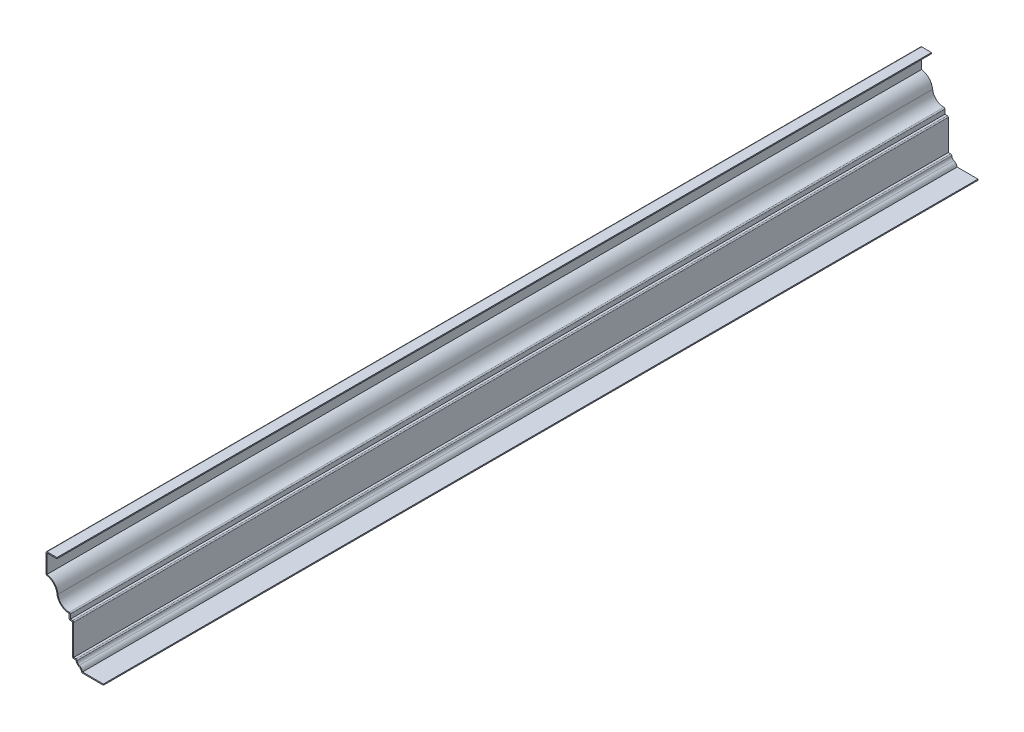
ISO-10303-21;
HEADER;
FILE_DESCRIPTION(('STEP AP214'),'2;1');
FILE_NAME('part.step','',(''),(''),'','','');
FILE_SCHEMA(('AUTOMOTIVE_DESIGN { 1 0 10303 214 1 1 1 1 }'));
ENDSEC;
DATA;
#1=APPLICATION_CONTEXT('core data for automotive mechanical design processes');
#2=APPLICATION_PROTOCOL_DEFINITION('international standard','automotive_design',2000,#1);
#3=PRODUCT_CONTEXT('',#1,'mechanical');
#4=PRODUCT('Part','Part','',(#3));
#5=PRODUCT_RELATED_PRODUCT_CATEGORY('part','',(#4));
#6=PRODUCT_DEFINITION_FORMATION('','',#4);
#7=PRODUCT_DEFINITION_CONTEXT('part definition',#1,'design');
#8=PRODUCT_DEFINITION('design','',#6,#7);
#9=PRODUCT_DEFINITION_SHAPE('','',#8);
#10=(LENGTH_UNIT() NAMED_UNIT(*) SI_UNIT(.MILLI.,.METRE.));
#11=(NAMED_UNIT(*) PLANE_ANGLE_UNIT() SI_UNIT($,.RADIAN.));
#12=(NAMED_UNIT(*) SI_UNIT($,.STERADIAN.) SOLID_ANGLE_UNIT());
#13=UNCERTAINTY_MEASURE_WITH_UNIT(LENGTH_MEASURE(1.E-05),#10,'distance_accuracy_value','');
#14=(GEOMETRIC_REPRESENTATION_CONTEXT(3) GLOBAL_UNCERTAINTY_ASSIGNED_CONTEXT((#13)) GLOBAL_UNIT_ASSIGNED_CONTEXT((#10,
#11,#12)) REPRESENTATION_CONTEXT('',''));
#15=CARTESIAN_POINT('',(0.,0.,0.));
#16=DIRECTION('',(0.,0.,1.));
#17=DIRECTION('',(1.,0.,0.));
#18=AXIS2_PLACEMENT_3D('',#15,#16,#17);
#19=CARTESIAN_POINT('',(-66.675,100.33,-1016.));
#20=DIRECTION('',(0.,-1.,0.));
#21=DIRECTION('',(0.,0.,-1.));
#22=AXIS2_PLACEMENT_3D('',#19,#20,#21);
#23=PLANE('',#22);
#24=DIRECTION('',(1.,0.,0.));
#25=VECTOR('',#24,1.);
#26=CARTESIAN_POINT('',(-66.675,100.33,0.));
#27=LINE('',#26,#25);
#28=CARTESIAN_POINT('',(-65.405,100.33,0.));
#29=VERTEX_POINT('',#28);
#30=CARTESIAN_POINT('',(-53.975,100.33,0.));
#31=VERTEX_POINT('',#30);
#32=EDGE_CURVE('E327',#29,#31,#27,.T.);
#33=ORIENTED_EDGE('',*,*,#32,.F.);
#34=DIRECTION('',(0.,0.,1.));
#35=VECTOR('',#34,1.);
#36=CARTESIAN_POINT('',(-65.405,100.33,-1016.));
#37=LINE('',#36,#35);
#38=CARTESIAN_POINT('',(-65.405,100.33,-1016.));
#39=VERTEX_POINT('',#38);
#40=EDGE_CURVE('E269',#39,#29,#37,.T.);
#41=ORIENTED_EDGE('',*,*,#40,.F.);
#42=DIRECTION('',(1.,0.,0.));
#43=VECTOR('',#42,1.);
#44=CARTESIAN_POINT('',(-66.675,100.33,-1016.));
#45=LINE('',#44,#43);
#46=CARTESIAN_POINT('',(-53.975,100.33,-1016.));
#47=VERTEX_POINT('',#46);
#48=EDGE_CURVE('E251',#39,#47,#45,.T.);
#49=ORIENTED_EDGE('',*,*,#48,.T.);
#50=DIRECTION('',(0.,0.,1.));
#51=VECTOR('',#50,1.);
#52=CARTESIAN_POINT('',(-53.975,100.33,-1016.));
#53=LINE('',#52,#51);
#54=EDGE_CURVE('E259',#47,#31,#53,.T.);
#55=ORIENTED_EDGE('',*,*,#54,.T.);
#56=EDGE_LOOP('',(#33,#41,#49,#55));
#57=FACE_BOUND('',#56,.T.);
#58=ADVANCED_FACE('F35',(#57),#23,.T.);
#59=CARTESIAN_POINT('',(-65.405,77.7875,-1016.));
#60=DIRECTION('',(1.,0.,0.));
#61=DIRECTION('',(0.,0.,-1.));
#62=AXIS2_PLACEMENT_3D('',#59,#60,#61);
#63=PLANE('',#62);
#64=DIRECTION('',(0.,1.,0.));
#65=VECTOR('',#64,1.);
#66=CARTESIAN_POINT('',(-65.405,77.7875,0.));
#67=LINE('',#66,#65);
#68=CARTESIAN_POINT('',(-65.405,78.882322780888,0.));
#69=VERTEX_POINT('',#68);
#70=EDGE_CURVE('E270',#69,#29,#67,.T.);
#71=ORIENTED_EDGE('',*,*,#70,.F.);
#72=DIRECTION('',(0.,0.,1.));
#73=VECTOR('',#72,1.);
#74=CARTESIAN_POINT('',(-65.405,78.882322780888,-1016.));
#75=LINE('',#74,#73);
#76=CARTESIAN_POINT('',(-65.405,78.882322780888,-1016.));
#77=VERTEX_POINT('',#76);
#78=EDGE_CURVE('E383',#77,#69,#75,.T.);
#79=ORIENTED_EDGE('',*,*,#78,.F.);
#80=DIRECTION('',(0.,1.,0.));
#81=VECTOR('',#80,1.);
#82=CARTESIAN_POINT('',(-65.405,77.7875,-1016.));
#83=LINE('',#82,#81);
#84=EDGE_CURVE('E267',#77,#39,#83,.T.);
#85=ORIENTED_EDGE('',*,*,#84,.T.);
#86=ORIENTED_EDGE('',*,*,#40,.T.);
#87=EDGE_LOOP('',(#71,#79,#85,#86));
#88=FACE_BOUND('',#87,.T.);
#89=ADVANCED_FACE('F506',(#88),#63,.T.);
#90=CARTESIAN_POINT('',(-68.2625,63.4944115243071,-1016.));
#91=DIRECTION('',(0.,0.,1.));
#92=DIRECTION('',(1.,0.,0.));
#93=AXIS2_PLACEMENT_3D('',#90,#91,#92);
#94=CYLINDRICAL_SURFACE('',#93,15.650978215128);
#95=CARTESIAN_POINT('',(-68.2625,63.4944115243071,0.));
#96=DIRECTION('',(0.,0.,1.));
#97=DIRECTION('',(1.,0.,0.));
#98=AXIS2_PLACEMENT_3D('',#95,#96,#97);
#99=CIRCLE('',#98,15.650978215128);
#100=CARTESIAN_POINT('',(-52.7132551639699,65.2760130845893,0.));
#101=VERTEX_POINT('',#100);
#102=EDGE_CURVE('E273',#101,#69,#99,.T.);
#103=ORIENTED_EDGE('',*,*,#102,.F.);
#104=DIRECTION('',(0.,0.,1.));
#105=VECTOR('',#104,1.);
#106=CARTESIAN_POINT('',(-52.7132551639699,65.2760130845893,-1016.));
#107=LINE('',#106,#105);
#108=CARTESIAN_POINT('',(-52.7132551639699,65.2760130845893,-1016.));
#109=VERTEX_POINT('',#108);
#110=EDGE_CURVE('E385',#109,#101,#107,.T.);
#111=ORIENTED_EDGE('',*,*,#110,.F.);
#112=CARTESIAN_POINT('',(-68.2625,63.4944115243071,-1016.));
#113=DIRECTION('',(0.,0.,1.));
#114=DIRECTION('',(1.,0.,0.));
#115=AXIS2_PLACEMENT_3D('',#112,#113,#114);
#116=CIRCLE('',#115,15.650978215128);
#117=EDGE_CURVE('E323',#109,#77,#116,.T.);
#118=ORIENTED_EDGE('',*,*,#117,.T.);
#119=ORIENTED_EDGE('',*,*,#78,.T.);
#120=EDGE_LOOP('',(#103,#111,#118,#119));
#121=FACE_BOUND('',#120,.T.);
#122=ADVANCED_FACE('F512',(#121),#94,.T.);
#123=CARTESIAN_POINT('',(-39.6875,66.768478215128,-1016.));
#124=DIRECTION('',(0.,0.,1.));
#125=DIRECTION('',(1.,0.,0.));
#126=AXIS2_PLACEMENT_3D('',#123,#124,#125);
#127=CYLINDRICAL_SURFACE('',#126,13.110978215128);
#128=CARTESIAN_POINT('',(-39.6875,66.768478215128,0.));
#129=DIRECTION('',(0.,0.,1.));
#130=DIRECTION('',(1.,0.,0.));
#131=AXIS2_PLACEMENT_3D('',#128,#129,#130);
#132=CIRCLE('',#131,13.110978215128);
#133=CARTESIAN_POINT('',(-39.6875,53.6575,0.));
#134=VERTEX_POINT('',#133);
#135=EDGE_CURVE('E377',#134,#101,#132,.F.);
#136=ORIENTED_EDGE('',*,*,#135,.F.);
#137=DIRECTION('',(0.,0.,1.));
#138=VECTOR('',#137,1.);
#139=CARTESIAN_POINT('',(-39.6875,53.6575,-1016.));
#140=LINE('',#139,#138);
#141=CARTESIAN_POINT('',(-39.6875,53.6575,-1016.));
#142=VERTEX_POINT('',#141);
#143=EDGE_CURVE('E477',#134,#142,#140,.F.);
#144=ORIENTED_EDGE('',*,*,#143,.T.);
#145=CARTESIAN_POINT('',(-39.6875,66.768478215128,-1016.));
#146=DIRECTION('',(0.,0.,1.));
#147=DIRECTION('',(1.,0.,0.));
#148=AXIS2_PLACEMENT_3D('',#145,#146,#147);
#149=CIRCLE('',#148,13.110978215128);
#150=EDGE_CURVE('E321',#142,#109,#149,.F.);
#151=ORIENTED_EDGE('',*,*,#150,.T.);
#152=ORIENTED_EDGE('',*,*,#110,.T.);
#153=EDGE_LOOP('',(#136,#144,#151,#152));
#154=FACE_BOUND('',#153,.T.);
#155=ADVANCED_FACE('F515',(#154),#127,.F.);
#156=CARTESIAN_POINT('',(-38.4175,46.0375,-1016.));
#157=DIRECTION('',(1.,0.,0.));
#158=DIRECTION('',(0.,1.,0.));
#159=AXIS2_PLACEMENT_3D('',#156,#157,#158);
#160=PLANE('',#159);
#161=DIRECTION('',(0.,1.,0.));
#162=VECTOR('',#161,1.);
#163=CARTESIAN_POINT('',(-38.4175,46.0375,-1016.));
#164=LINE('',#163,#162);
#165=CARTESIAN_POINT('',(-38.4175,47.3075,-1016.));
#166=VERTEX_POINT('',#165);
#167=CARTESIAN_POINT('',(-38.4175,52.3875,-1016.));
#168=VERTEX_POINT('',#167);
#169=EDGE_CURVE('E318',#166,#168,#164,.T.);
#170=ORIENTED_EDGE('',*,*,#169,.T.);
#171=DIRECTION('',(0.,0.,1.));
#172=VECTOR('',#171,1.);
#173=CARTESIAN_POINT('',(-38.4175,52.3875,-1016.));
#174=LINE('',#173,#172);
#175=CARTESIAN_POINT('',(-38.4175,52.3875,0.));
#176=VERTEX_POINT('',#175);
#177=EDGE_CURVE('E474',#168,#176,#174,.T.);
#178=ORIENTED_EDGE('',*,*,#177,.T.);
#179=DIRECTION('',(0.,1.,0.));
#180=VECTOR('',#179,1.);
#181=CARTESIAN_POINT('',(-38.4175,46.0375,0.));
#182=LINE('',#181,#180);
#183=CARTESIAN_POINT('',(-38.4175,47.3075,0.));
#184=VERTEX_POINT('',#183);
#185=EDGE_CURVE('E374',#184,#176,#182,.T.);
#186=ORIENTED_EDGE('',*,*,#185,.F.);
#187=DIRECTION('',(0.,0.,1.));
#188=VECTOR('',#187,1.);
#189=CARTESIAN_POINT('',(-38.4175,47.3075,-1016.));
#190=LINE('',#189,#188);
#191=EDGE_CURVE('E388',#166,#184,#190,.T.);
#192=ORIENTED_EDGE('',*,*,#191,.F.);
#193=EDGE_LOOP('',(#170,#178,#186,#192));
#194=FACE_BOUND('',#193,.T.);
#195=ADVANCED_FACE('F524',(#194),#160,.T.);
#196=CARTESIAN_POINT('',(-35.71875,47.3075,-1016.));
#197=DIRECTION('',(0.,1.,0.));
#198=DIRECTION('',(0.,0.,1.));
#199=AXIS2_PLACEMENT_3D('',#196,#197,#198);
#200=PLANE('',#199);
#201=DIRECTION('',(1.,0.,0.));
#202=VECTOR('',#201,1.);
#203=CARTESIAN_POINT('',(-35.71875,47.3075,0.));
#204=LINE('',#203,#202);
#205=CARTESIAN_POINT('',(-35.71875,47.3075,0.));
#206=VERTEX_POINT('',#205);
#207=EDGE_CURVE('E372',#206,#184,#204,.F.);
#208=ORIENTED_EDGE('',*,*,#207,.F.);
#209=DIRECTION('',(0.,0.,1.));
#210=VECTOR('',#209,1.);
#211=CARTESIAN_POINT('',(-35.71875,47.3075,-1016.));
#212=LINE('',#211,#210);
#213=CARTESIAN_POINT('',(-35.71875,47.3075,-1016.));
#214=VERTEX_POINT('',#213);
#215=EDGE_CURVE('E467',#206,#214,#212,.F.);
#216=ORIENTED_EDGE('',*,*,#215,.T.);
#217=DIRECTION('',(1.,0.,0.));
#218=VECTOR('',#217,1.);
#219=CARTESIAN_POINT('',(-35.71875,47.3075,-1016.));
#220=LINE('',#219,#218);
#221=EDGE_CURVE('E316',#214,#166,#220,.F.);
#222=ORIENTED_EDGE('',*,*,#221,.T.);
#223=ORIENTED_EDGE('',*,*,#191,.T.);
#224=EDGE_LOOP('',(#208,#216,#222,#223));
#225=FACE_BOUND('',#224,.T.);
#226=ADVANCED_FACE('F528',(#225),#200,.T.);
#227=CARTESIAN_POINT('',(-34.44875,9.52499999999997,-1016.));
#228=DIRECTION('',(1.,0.,0.));
#229=DIRECTION('',(0.,1.,0.));
#230=AXIS2_PLACEMENT_3D('',#227,#228,#229);
#231=PLANE('',#230);
#232=DIRECTION('',(0.,1.,0.));
#233=VECTOR('',#232,1.);
#234=CARTESIAN_POINT('',(-34.44875,9.52499999999997,-1016.));
#235=LINE('',#234,#233);
#236=CARTESIAN_POINT('',(-34.44875,10.795,-1016.));
#237=VERTEX_POINT('',#236);
#238=CARTESIAN_POINT('',(-34.44875,46.0375,-1016.));
#239=VERTEX_POINT('',#238);
#240=EDGE_CURVE('E313',#237,#239,#235,.T.);
#241=ORIENTED_EDGE('',*,*,#240,.T.);
#242=DIRECTION('',(0.,0.,1.));
#243=VECTOR('',#242,1.);
#244=CARTESIAN_POINT('',(-34.44875,46.0375,-1016.));
#245=LINE('',#244,#243);
#246=CARTESIAN_POINT('',(-34.44875,46.0375,0.));
#247=VERTEX_POINT('',#246);
#248=EDGE_CURVE('E464',#239,#247,#245,.T.);
#249=ORIENTED_EDGE('',*,*,#248,.T.);
#250=DIRECTION('',(0.,1.,0.));
#251=VECTOR('',#250,1.);
#252=CARTESIAN_POINT('',(-34.44875,9.52499999999997,0.));
#253=LINE('',#252,#251);
#254=CARTESIAN_POINT('',(-34.44875,10.795,0.));
#255=VERTEX_POINT('',#254);
#256=EDGE_CURVE('E369',#255,#247,#253,.T.);
#257=ORIENTED_EDGE('',*,*,#256,.F.);
#258=DIRECTION('',(0.,0.,1.));
#259=VECTOR('',#258,1.);
#260=CARTESIAN_POINT('',(-34.44875,10.795,-1016.));
#261=LINE('',#260,#259);
#262=EDGE_CURVE('E391',#237,#255,#261,.T.);
#263=ORIENTED_EDGE('',*,*,#262,.F.);
#264=EDGE_LOOP('',(#241,#249,#257,#263));
#265=FACE_BOUND('',#264,.T.);
#266=ADVANCED_FACE('F537',(#265),#231,.T.);
#267=CARTESIAN_POINT('',(-31.75,10.795,-1016.));
#268=DIRECTION('',(0.,1.,0.));
#269=DIRECTION('',(-1.,0.,0.));
#270=AXIS2_PLACEMENT_3D('',#267,#268,#269);
#271=PLANE('',#270);
#272=DIRECTION('',(-1.,0.,0.));
#273=VECTOR('',#272,1.);
#274=CARTESIAN_POINT('',(-31.75,10.795,0.));
#275=LINE('',#274,#273);
#276=CARTESIAN_POINT('',(-31.75,10.795,0.));
#277=VERTEX_POINT('',#276);
#278=EDGE_CURVE('E367',#277,#255,#275,.T.);
#279=ORIENTED_EDGE('',*,*,#278,.F.);
#280=DIRECTION('',(0.,0.,1.));
#281=VECTOR('',#280,1.);
#282=CARTESIAN_POINT('',(-31.75,10.795,-1016.));
#283=LINE('',#282,#281);
#284=CARTESIAN_POINT('',(-31.75,10.795,-1016.));
#285=VERTEX_POINT('',#284);
#286=EDGE_CURVE('E457',#277,#285,#283,.F.);
#287=ORIENTED_EDGE('',*,*,#286,.T.);
#288=DIRECTION('',(-1.,0.,0.));
#289=VECTOR('',#288,1.);
#290=CARTESIAN_POINT('',(-31.75,10.795,-1016.));
#291=LINE('',#290,#289);
#292=EDGE_CURVE('E311',#285,#237,#291,.T.);
#293=ORIENTED_EDGE('',*,*,#292,.T.);
#294=ORIENTED_EDGE('',*,*,#262,.T.);
#295=EDGE_LOOP('',(#279,#287,#293,#294));
#296=FACE_BOUND('',#295,.T.);
#297=ADVANCED_FACE('F542',(#296),#271,.T.);
#298=CARTESIAN_POINT('',(-26.590625,9.52499999999997,-1016.));
#299=DIRECTION('',(0.,0.,1.));
#300=DIRECTION('',(1.,0.,0.));
#301=AXIS2_PLACEMENT_3D('',#298,#299,#300);
#302=CYLINDRICAL_SURFACE('',#301,3.88937499999999);
#303=CARTESIAN_POINT('',(-26.590625,9.52499999999997,-1016.));
#304=DIRECTION('',(0.,0.,1.));
#305=DIRECTION('',(1.,0.,0.));
#306=AXIS2_PLACEMENT_3D('',#303,#304,#305);
#307=CIRCLE('',#306,3.88937499999999);
#308=CARTESIAN_POINT('',(-28.0865384615385,5.93480769230767,-1016.));
#309=VERTEX_POINT('',#308);
#310=CARTESIAN_POINT('',(-30.48,9.52499999999997,-1016.));
#311=VERTEX_POINT('',#310);
#312=EDGE_CURVE('E308',#309,#311,#307,.F.);
#313=ORIENTED_EDGE('',*,*,#312,.T.);
#314=DIRECTION('',(0.,0.,1.));
#315=VECTOR('',#314,1.);
#316=CARTESIAN_POINT('',(-30.48,9.52499999999997,-1016.));
#317=LINE('',#316,#315);
#318=CARTESIAN_POINT('',(-30.48,9.52499999999997,0.));
#319=VERTEX_POINT('',#318);
#320=EDGE_CURVE('E454',#311,#319,#317,.T.);
#321=ORIENTED_EDGE('',*,*,#320,.T.);
#322=CARTESIAN_POINT('',(-26.590625,9.52499999999997,0.));
#323=DIRECTION('',(0.,0.,1.));
#324=DIRECTION('',(1.,0.,0.));
#325=AXIS2_PLACEMENT_3D('',#322,#323,#324);
#326=CIRCLE('',#325,3.88937499999999);
#327=CARTESIAN_POINT('',(-28.0865384615385,5.93480769230767,0.));
#328=VERTEX_POINT('',#327);
#329=EDGE_CURVE('E364',#328,#319,#326,.F.);
#330=ORIENTED_EDGE('',*,*,#329,.F.);
#331=DIRECTION('',(0.,0.,1.));
#332=VECTOR('',#331,1.);
#333=CARTESIAN_POINT('',(-28.0865384615385,5.93480769230767,-1016.));
#334=LINE('',#333,#332);
#335=EDGE_CURVE('E394',#309,#328,#334,.T.);
#336=ORIENTED_EDGE('',*,*,#335,.F.);
#337=EDGE_LOOP('',(#313,#321,#330,#336));
#338=FACE_BOUND('',#337,.T.);
#339=ADVANCED_FACE('F551',(#338),#302,.F.);
#340=CARTESIAN_POINT('',(-30.559375,0.,-1016.));
#341=DIRECTION('',(0.,0.,1.));
#342=DIRECTION('',(1.,0.,0.));
#343=AXIS2_PLACEMENT_3D('',#340,#341,#342);
#344=CYLINDRICAL_SURFACE('',#343,6.42937499999999);
#345=CARTESIAN_POINT('',(-30.559375,0.,0.));
#346=DIRECTION('',(0.,0.,1.));
#347=DIRECTION('',(1.,0.,0.));
#348=AXIS2_PLACEMENT_3D('',#345,#346,#347);
#349=CIRCLE('',#348,6.42937499999999);
#350=CARTESIAN_POINT('',(-24.2566801088741,1.27,0.));
#351=VERTEX_POINT('',#350);
#352=EDGE_CURVE('E361',#351,#328,#349,.T.);
#353=ORIENTED_EDGE('',*,*,#352,.F.);
#354=DIRECTION('',(0.,0.,1.));
#355=VECTOR('',#354,1.);
#356=CARTESIAN_POINT('',(-24.2566801088741,1.27,-1016.));
#357=LINE('',#356,#355);
#358=CARTESIAN_POINT('',(-24.2566801088741,1.27,-1016.));
#359=VERTEX_POINT('',#358);
#360=EDGE_CURVE('E396',#359,#351,#357,.T.);
#361=ORIENTED_EDGE('',*,*,#360,.F.);
#362=CARTESIAN_POINT('',(-30.559375,0.,-1016.));
#363=DIRECTION('',(0.,0.,1.));
#364=DIRECTION('',(1.,0.,0.));
#365=AXIS2_PLACEMENT_3D('',#362,#363,#364);
#366=CIRCLE('',#365,6.42937499999999);
#367=EDGE_CURVE('E305',#359,#309,#366,.T.);
#368=ORIENTED_EDGE('',*,*,#367,.T.);
#369=ORIENTED_EDGE('',*,*,#335,.T.);
#370=EDGE_LOOP('',(#353,#361,#368,#369));
#371=FACE_BOUND('',#370,.T.);
#372=ADVANCED_FACE('F556',(#371),#344,.T.);
#373=CARTESIAN_POINT('',(0.,1.27,-1016.));
#374=DIRECTION('',(0.,1.,0.));
#375=DIRECTION('',(-1.,0.,0.));
#376=AXIS2_PLACEMENT_3D('',#373,#374,#375);
#377=PLANE('',#376);
#378=DIRECTION('',(-1.,0.,0.));
#379=VECTOR('',#378,1.);
#380=CARTESIAN_POINT('',(0.,1.27,0.));
#381=LINE('',#380,#379);
#382=CARTESIAN_POINT('',(0.,1.27,0.));
#383=VERTEX_POINT('',#382);
#384=EDGE_CURVE('E358',#383,#351,#381,.T.);
#385=ORIENTED_EDGE('',*,*,#384,.F.);
#386=DIRECTION('',(0.,0.,1.));
#387=VECTOR('',#386,1.);
#388=CARTESIAN_POINT('',(0.,1.27,-1016.));
#389=LINE('',#388,#387);
#390=CARTESIAN_POINT('',(0.,1.27,-1016.));
#391=VERTEX_POINT('',#390);
#392=EDGE_CURVE('E398',#391,#383,#389,.T.);
#393=ORIENTED_EDGE('',*,*,#392,.F.);
#394=DIRECTION('',(-1.,0.,0.));
#395=VECTOR('',#394,1.);
#396=CARTESIAN_POINT('',(0.,1.27,-1016.));
#397=LINE('',#396,#395);
#398=EDGE_CURVE('E302',#391,#359,#397,.T.);
#399=ORIENTED_EDGE('',*,*,#398,.T.);
#400=ORIENTED_EDGE('',*,*,#360,.T.);
#401=EDGE_LOOP('',(#385,#393,#399,#400));
#402=FACE_BOUND('',#401,.T.);
#403=ADVANCED_FACE('F560',(#402),#377,.T.);
#404=CARTESIAN_POINT('',(0.,1.27,-1016.));
#405=DIRECTION('',(-1.,0.,0.));
#406=DIRECTION('',(0.,-1.,0.));
#407=AXIS2_PLACEMENT_3D('',#404,#405,#406);
#408=PLANE('',#407);
#409=DIRECTION('',(0.,-1.,0.));
#410=VECTOR('',#409,1.);
#411=CARTESIAN_POINT('',(0.,1.27,0.));
#412=LINE('',#411,#410);
#413=CARTESIAN_POINT('',(0.,0.,0.));
#414=VERTEX_POINT('',#413);
#415=EDGE_CURVE('E356',#383,#414,#412,.T.);
#416=ORIENTED_EDGE('',*,*,#415,.T.);
#417=DIRECTION('',(0.,0.,1.));
#418=VECTOR('',#417,1.);
#419=CARTESIAN_POINT('',(0.,0.,-1016.));
#420=LINE('',#419,#418);
#421=CARTESIAN_POINT('',(0.,0.,-1016.));
#422=VERTEX_POINT('',#421);
#423=EDGE_CURVE('E400',#422,#414,#420,.T.);
#424=ORIENTED_EDGE('',*,*,#423,.F.);
#425=DIRECTION('',(0.,-1.,0.));
#426=VECTOR('',#425,1.);
#427=CARTESIAN_POINT('',(0.,1.27,-1016.));
#428=LINE('',#427,#426);
#429=EDGE_CURVE('E300',#391,#422,#428,.T.);
#430=ORIENTED_EDGE('',*,*,#429,.F.);
#431=ORIENTED_EDGE('',*,*,#392,.T.);
#432=EDGE_LOOP('',(#416,#424,#430,#431));
#433=FACE_BOUND('',#432,.T.);
#434=ADVANCED_FACE('F564',(#433),#408,.F.);
#435=CARTESIAN_POINT('',(0.,0.,-1016.));
#436=DIRECTION('',(0.,1.,0.));
#437=DIRECTION('',(-1.,0.,0.));
#438=AXIS2_PLACEMENT_3D('',#435,#436,#437);
#439=PLANE('',#438);
#440=DIRECTION('',(-1.,0.,0.));
#441=VECTOR('',#440,1.);
#442=CARTESIAN_POINT('',(0.,0.,0.));
#443=LINE('',#442,#441);
#444=CARTESIAN_POINT('',(-24.2566801088741,0.,0.));
#445=VERTEX_POINT('',#444);
#446=EDGE_CURVE('E353',#414,#445,#443,.T.);
#447=ORIENTED_EDGE('',*,*,#446,.T.);
#448=DIRECTION('',(0.,0.,1.));
#449=VECTOR('',#448,1.);
#450=CARTESIAN_POINT('',(-24.2566801088741,0.,-1016.));
#451=LINE('',#450,#449);
#452=CARTESIAN_POINT('',(-24.2566801088741,0.,-1016.));
#453=VERTEX_POINT('',#452);
#454=EDGE_CURVE('E437',#445,#453,#451,.F.);
#455=ORIENTED_EDGE('',*,*,#454,.T.);
#456=DIRECTION('',(-1.,0.,0.));
#457=VECTOR('',#456,1.);
#458=CARTESIAN_POINT('',(0.,0.,-1016.));
#459=LINE('',#458,#457);
#460=EDGE_CURVE('E298',#422,#453,#459,.T.);
#461=ORIENTED_EDGE('',*,*,#460,.F.);
#462=ORIENTED_EDGE('',*,*,#423,.T.);
#463=EDGE_LOOP('',(#447,#455,#461,#462));
#464=FACE_BOUND('',#463,.T.);
#465=ADVANCED_FACE('F769',(#464),#439,.F.);
#466=CARTESIAN_POINT('',(-30.559375,0.,-1016.));
#467=DIRECTION('',(0.,0.,1.));
#468=DIRECTION('',(1.,0.,0.));
#469=AXIS2_PLACEMENT_3D('',#466,#467,#468);
#470=CYLINDRICAL_SURFACE('',#469,5.15937499999999);
#471=CARTESIAN_POINT('',(-30.559375,0.,-1016.));
#472=DIRECTION('',(0.,0.,1.));
#473=DIRECTION('',(1.,0.,0.));
#474=AXIS2_PLACEMENT_3D('',#471,#472,#473);
#475=CIRCLE('',#474,5.15937499999999);
#476=CARTESIAN_POINT('',(-25.5016568774915,1.01913580246913,-1016.));
#477=VERTEX_POINT('',#476);
#478=CARTESIAN_POINT('',(-28.575,4.76249999999998,-1016.));
#479=VERTEX_POINT('',#478);
#480=EDGE_CURVE('E296',#477,#479,#475,.T.);
#481=ORIENTED_EDGE('',*,*,#480,.F.);
#482=DIRECTION('',(0.,0.,1.));
#483=VECTOR('',#482,1.);
#484=CARTESIAN_POINT('',(-25.5016568774915,1.01913580246913,-1016.));
#485=LINE('',#484,#483);
#486=CARTESIAN_POINT('',(-25.5016568774915,1.01913580246913,0.));
#487=VERTEX_POINT('',#486);
#488=EDGE_CURVE('E382',#477,#487,#485,.T.);
#489=ORIENTED_EDGE('',*,*,#488,.T.);
#490=CARTESIAN_POINT('',(-30.559375,0.,0.));
#491=DIRECTION('',(0.,0.,1.));
#492=DIRECTION('',(1.,0.,0.));
#493=AXIS2_PLACEMENT_3D('',#490,#491,#492);
#494=CIRCLE('',#493,5.15937499999999);
#495=CARTESIAN_POINT('',(-28.575,4.76249999999998,0.));
#496=VERTEX_POINT('',#495);
#497=EDGE_CURVE('E351',#487,#496,#494,.T.);
#498=ORIENTED_EDGE('',*,*,#497,.T.);
#499=DIRECTION('',(0.,0.,1.));
#500=VECTOR('',#499,1.);
#501=CARTESIAN_POINT('',(-28.575,4.76249999999998,-1016.));
#502=LINE('',#501,#500);
#503=EDGE_CURVE('E403',#479,#496,#502,.T.);
#504=ORIENTED_EDGE('',*,*,#503,.F.);
#505=EDGE_LOOP('',(#481,#489,#498,#504));
#506=FACE_BOUND('',#505,.T.);
#507=ADVANCED_FACE('F574',(#506),#470,.F.);
#508=CARTESIAN_POINT('',(-26.590625,9.52499999999997,-1016.));
#509=DIRECTION('',(0.,0.,1.));
#510=DIRECTION('',(1.,0.,0.));
#511=AXIS2_PLACEMENT_3D('',#508,#509,#510);
#512=CYLINDRICAL_SURFACE('',#511,5.15937499999999);
#513=CARTESIAN_POINT('',(-26.590625,9.52499999999997,0.));
#514=DIRECTION('',(0.,0.,-1.));
#515=DIRECTION('',(-1.,0.,0.));
#516=AXIS2_PLACEMENT_3D('',#513,#514,#515);
#517=CIRCLE('',#516,5.15937499999999);
#518=CARTESIAN_POINT('',(-31.75,9.52499999999997,0.));
#519=VERTEX_POINT('',#518);
#520=EDGE_CURVE('E349',#496,#519,#517,.T.);
#521=ORIENTED_EDGE('',*,*,#520,.T.);
#522=DIRECTION('',(0.,0.,1.));
#523=VECTOR('',#522,1.);
#524=CARTESIAN_POINT('',(-31.75,9.52499999999997,-1016.));
#525=LINE('',#524,#523);
#526=CARTESIAN_POINT('',(-31.75,9.52499999999997,-1016.));
#527=VERTEX_POINT('',#526);
#528=EDGE_CURVE('E406',#527,#519,#525,.T.);
#529=ORIENTED_EDGE('',*,*,#528,.F.);
#530=CARTESIAN_POINT('',(-26.590625,9.52499999999997,-1016.));
#531=DIRECTION('',(0.,0.,-1.));
#532=DIRECTION('',(-1.,0.,0.));
#533=AXIS2_PLACEMENT_3D('',#530,#531,#532);
#534=CIRCLE('',#533,5.15937499999999);
#535=EDGE_CURVE('E294',#479,#527,#534,.T.);
#536=ORIENTED_EDGE('',*,*,#535,.F.);
#537=ORIENTED_EDGE('',*,*,#503,.T.);
#538=EDGE_LOOP('',(#521,#529,#536,#537));
#539=FACE_BOUND('',#538,.T.);
#540=ADVANCED_FACE('F581',(#539),#512,.T.);
#541=CARTESIAN_POINT('',(-31.75,9.52499999999997,-1016.));
#542=DIRECTION('',(0.,1.,0.));
#543=DIRECTION('',(-1.,0.,0.));
#544=AXIS2_PLACEMENT_3D('',#541,#542,#543);
#545=PLANE('',#544);
#546=DIRECTION('',(-1.,0.,0.));
#547=VECTOR('',#546,1.);
#548=CARTESIAN_POINT('',(-31.75,9.52499999999997,0.));
#549=LINE('',#548,#547);
#550=CARTESIAN_POINT('',(-34.44875,9.52499999999997,0.));
#551=VERTEX_POINT('',#550);
#552=EDGE_CURVE('E346',#519,#551,#549,.T.);
#553=ORIENTED_EDGE('',*,*,#552,.T.);
#554=DIRECTION('',(0.,0.,1.));
#555=VECTOR('',#554,1.);
#556=CARTESIAN_POINT('',(-34.44875,9.52499999999997,-1016.));
#557=LINE('',#556,#555);
#558=CARTESIAN_POINT('',(-34.44875,9.52499999999997,-1016.));
#559=VERTEX_POINT('',#558);
#560=EDGE_CURVE('E462',#551,#559,#557,.F.);
#561=ORIENTED_EDGE('',*,*,#560,.T.);
#562=DIRECTION('',(-1.,0.,0.));
#563=VECTOR('',#562,1.);
#564=CARTESIAN_POINT('',(-31.75,9.52499999999997,-1016.));
#565=LINE('',#564,#563);
#566=EDGE_CURVE('E291',#527,#559,#565,.T.);
#567=ORIENTED_EDGE('',*,*,#566,.F.);
#568=ORIENTED_EDGE('',*,*,#528,.T.);
#569=EDGE_LOOP('',(#553,#561,#567,#568));
#570=FACE_BOUND('',#569,.T.);
#571=ADVANCED_FACE('F585',(#570),#545,.F.);
#572=CARTESIAN_POINT('',(-35.71875,9.52499999999997,-1016.));
#573=DIRECTION('',(1.,0.,0.));
#574=DIRECTION('',(0.,1.,0.));
#575=AXIS2_PLACEMENT_3D('',#572,#573,#574);
#576=PLANE('',#575);
#577=DIRECTION('',(0.,1.,0.));
#578=VECTOR('',#577,1.);
#579=CARTESIAN_POINT('',(-35.71875,9.52499999999997,-1016.));
#580=LINE('',#579,#578);
#581=CARTESIAN_POINT('',(-35.71875,10.795,-1016.));
#582=VERTEX_POINT('',#581);
#583=CARTESIAN_POINT('',(-35.71875,46.0375,-1016.));
#584=VERTEX_POINT('',#583);
#585=EDGE_CURVE('E289',#582,#584,#580,.T.);
#586=ORIENTED_EDGE('',*,*,#585,.F.);
#587=DIRECTION('',(0.,0.,1.));
#588=VECTOR('',#587,1.);
#589=CARTESIAN_POINT('',(-35.71875,10.795,-1016.));
#590=LINE('',#589,#588);
#591=CARTESIAN_POINT('',(-35.71875,10.795,0.));
#592=VERTEX_POINT('',#591);
#593=EDGE_CURVE('E459',#582,#592,#590,.T.);
#594=ORIENTED_EDGE('',*,*,#593,.T.);
#595=DIRECTION('',(0.,1.,0.));
#596=VECTOR('',#595,1.);
#597=CARTESIAN_POINT('',(-35.71875,9.52499999999997,0.));
#598=LINE('',#597,#596);
#599=CARTESIAN_POINT('',(-35.71875,46.0375,0.));
#600=VERTEX_POINT('',#599);
#601=EDGE_CURVE('E344',#592,#600,#598,.T.);
#602=ORIENTED_EDGE('',*,*,#601,.T.);
#603=DIRECTION('',(0.,0.,1.));
#604=VECTOR('',#603,1.);
#605=CARTESIAN_POINT('',(-35.71875,46.0375,-1016.));
#606=LINE('',#605,#604);
#607=EDGE_CURVE('E409',#584,#600,#606,.T.);
#608=ORIENTED_EDGE('',*,*,#607,.F.);
#609=EDGE_LOOP('',(#586,#594,#602,#608));
#610=FACE_BOUND('',#609,.T.);
#611=ADVANCED_FACE('F594',(#610),#576,.F.);
#612=CARTESIAN_POINT('',(-35.71875,46.0375,-1016.));
#613=DIRECTION('',(0.,1.,0.));
#614=DIRECTION('',(0.,0.,1.));
#615=AXIS2_PLACEMENT_3D('',#612,#613,#614);
#616=PLANE('',#615);
#617=DIRECTION('',(-1.,0.,0.));
#618=VECTOR('',#617,1.);
#619=CARTESIAN_POINT('',(-35.71875,46.0375,0.));
#620=LINE('',#619,#618);
#621=CARTESIAN_POINT('',(-38.4175,46.0375,0.));
#622=VERTEX_POINT('',#621);
#623=EDGE_CURVE('E341',#600,#622,#620,.T.);
#624=ORIENTED_EDGE('',*,*,#623,.T.);
#625=DIRECTION('',(0.,0.,1.));
#626=VECTOR('',#625,1.);
#627=CARTESIAN_POINT('',(-38.4175,46.0375,-1016.));
#628=LINE('',#627,#626);
#629=CARTESIAN_POINT('',(-38.4175,46.0375,-1016.));
#630=VERTEX_POINT('',#629);
#631=EDGE_CURVE('E472',#622,#630,#628,.F.);
#632=ORIENTED_EDGE('',*,*,#631,.T.);
#633=DIRECTION('',(-1.,0.,0.));
#634=VECTOR('',#633,1.);
#635=CARTESIAN_POINT('',(-35.71875,46.0375,-1016.));
#636=LINE('',#635,#634);
#637=EDGE_CURVE('E286',#584,#630,#636,.T.);
#638=ORIENTED_EDGE('',*,*,#637,.F.);
#639=ORIENTED_EDGE('',*,*,#607,.T.);
#640=EDGE_LOOP('',(#624,#632,#638,#639));
#641=FACE_BOUND('',#640,.T.);
#642=ADVANCED_FACE('F600',(#641),#616,.F.);
#643=CARTESIAN_POINT('',(-39.6875,46.0375,-1016.));
#644=DIRECTION('',(1.,0.,0.));
#645=DIRECTION('',(0.,1.,0.));
#646=AXIS2_PLACEMENT_3D('',#643,#644,#645);
#647=PLANE('',#646);
#648=DIRECTION('',(0.,1.,0.));
#649=VECTOR('',#648,1.);
#650=CARTESIAN_POINT('',(-39.6875,46.0375,-1016.));
#651=LINE('',#650,#649);
#652=CARTESIAN_POINT('',(-39.6875,47.3075,-1016.));
#653=VERTEX_POINT('',#652);
#654=CARTESIAN_POINT('',(-39.6875,52.3875,-1016.));
#655=VERTEX_POINT('',#654);
#656=EDGE_CURVE('E284',#653,#655,#651,.T.);
#657=ORIENTED_EDGE('',*,*,#656,.F.);
#658=DIRECTION('',(0.,0.,1.));
#659=VECTOR('',#658,1.);
#660=CARTESIAN_POINT('',(-39.6875,47.3075,-1016.));
#661=LINE('',#660,#659);
#662=CARTESIAN_POINT('',(-39.6875,47.3075,0.));
#663=VERTEX_POINT('',#662);
#664=EDGE_CURVE('E469',#653,#663,#661,.T.);
#665=ORIENTED_EDGE('',*,*,#664,.T.);
#666=DIRECTION('',(0.,1.,0.));
#667=VECTOR('',#666,1.);
#668=CARTESIAN_POINT('',(-39.6875,46.0375,0.));
#669=LINE('',#668,#667);
#670=CARTESIAN_POINT('',(-39.6875,52.3875,0.));
#671=VERTEX_POINT('',#670);
#672=EDGE_CURVE('E339',#663,#671,#669,.T.);
#673=ORIENTED_EDGE('',*,*,#672,.T.);
#674=DIRECTION('',(0.,0.,1.));
#675=VECTOR('',#674,1.);
#676=CARTESIAN_POINT('',(-39.6875,52.3875,-1016.));
#677=LINE('',#676,#675);
#678=EDGE_CURVE('E412',#655,#671,#677,.T.);
#679=ORIENTED_EDGE('',*,*,#678,.F.);
#680=EDGE_LOOP('',(#657,#665,#673,#679));
#681=FACE_BOUND('',#680,.T.);
#682=ADVANCED_FACE('F609',(#681),#647,.F.);
#683=CARTESIAN_POINT('',(-39.6875,66.768478215128,-1016.));
#684=DIRECTION('',(0.,0.,1.));
#685=DIRECTION('',(1.,0.,0.));
#686=AXIS2_PLACEMENT_3D('',#683,#684,#685);
#687=CYLINDRICAL_SURFACE('',#686,14.380978215128);
#688=CARTESIAN_POINT('',(-39.6875,66.768478215128,0.));
#689=DIRECTION('',(0.,0.,-1.));
#690=DIRECTION('',(-1.,0.,0.));
#691=AXIS2_PLACEMENT_3D('',#688,#689,#690);
#692=CIRCLE('',#691,14.380978215128);
#693=CARTESIAN_POINT('',(-53.975,65.1314448697175,0.));
#694=VERTEX_POINT('',#693);
#695=EDGE_CURVE('E337',#671,#694,#692,.T.);
#696=ORIENTED_EDGE('',*,*,#695,.T.);
#697=DIRECTION('',(0.,0.,1.));
#698=VECTOR('',#697,1.);
#699=CARTESIAN_POINT('',(-53.975,65.1314448697175,-1016.));
#700=LINE('',#699,#698);
#701=CARTESIAN_POINT('',(-53.975,65.1314448697175,-1016.));
#702=VERTEX_POINT('',#701);
#703=EDGE_CURVE('E415',#702,#694,#700,.T.);
#704=ORIENTED_EDGE('',*,*,#703,.F.);
#705=CARTESIAN_POINT('',(-39.6875,66.768478215128,-1016.));
#706=DIRECTION('',(0.,0.,-1.));
#707=DIRECTION('',(-1.,0.,0.));
#708=AXIS2_PLACEMENT_3D('',#705,#706,#707);
#709=CIRCLE('',#708,14.380978215128);
#710=EDGE_CURVE('E282',#655,#702,#709,.T.);
#711=ORIENTED_EDGE('',*,*,#710,.F.);
#712=ORIENTED_EDGE('',*,*,#678,.T.);
#713=EDGE_LOOP('',(#696,#704,#711,#712));
#714=FACE_BOUND('',#713,.T.);
#715=ADVANCED_FACE('F612',(#714),#687,.T.);
#716=CARTESIAN_POINT('',(-68.2625,63.4944115243071,-1016.));
#717=DIRECTION('',(0.,0.,1.));
#718=DIRECTION('',(1.,0.,0.));
#719=AXIS2_PLACEMENT_3D('',#716,#717,#718);
#720=CYLINDRICAL_SURFACE('',#719,14.380978215128);
#721=CARTESIAN_POINT('',(-68.2625,63.4944115243071,0.));
#722=DIRECTION('',(0.,0.,1.));
#723=DIRECTION('',(1.,0.,0.));
#724=AXIS2_PLACEMENT_3D('',#721,#722,#723);
#725=CIRCLE('',#724,14.380978215128);
#726=CARTESIAN_POINT('',(-65.6368720881288,77.6336693723127,0.));
#727=VERTEX_POINT('',#726);
#728=EDGE_CURVE('E334',#694,#727,#725,.T.);
#729=ORIENTED_EDGE('',*,*,#728,.T.);
#730=DIRECTION('',(0.,0.,1.));
#731=VECTOR('',#730,1.);
#732=CARTESIAN_POINT('',(-65.6368720881288,77.6336693723127,-1016.));
#733=LINE('',#732,#731);
#734=CARTESIAN_POINT('',(-65.6368720881288,77.6336693723127,-1016.));
#735=VERTEX_POINT('',#734);
#736=EDGE_CURVE('E43',#727,#735,#733,.F.);
#737=ORIENTED_EDGE('',*,*,#736,.T.);
#738=CARTESIAN_POINT('',(-68.2625,63.4944115243071,-1016.));
#739=DIRECTION('',(0.,0.,1.));
#740=DIRECTION('',(1.,0.,0.));
#741=AXIS2_PLACEMENT_3D('',#738,#739,#740);
#742=CIRCLE('',#741,14.380978215128);
#743=EDGE_CURVE('E279',#702,#735,#742,.T.);
#744=ORIENTED_EDGE('',*,*,#743,.F.);
#745=ORIENTED_EDGE('',*,*,#703,.T.);
#746=EDGE_LOOP('',(#729,#737,#744,#745));
#747=FACE_BOUND('',#746,.T.);
#748=ADVANCED_FACE('F485',(#747),#720,.F.);
#749=CARTESIAN_POINT('',(-66.675,77.7875,-1016.));
#750=DIRECTION('',(1.,0.,0.));
#751=DIRECTION('',(0.,0.,-1.));
#752=AXIS2_PLACEMENT_3D('',#749,#750,#751);
#753=PLANE('',#752);
#754=DIRECTION('',(0.,1.,0.));
#755=VECTOR('',#754,1.);
#756=CARTESIAN_POINT('',(-66.675,77.7875,-1016.));
#757=LINE('',#756,#755);
#758=CARTESIAN_POINT('',(-66.675,78.882322780888,-1016.));
#759=VERTEX_POINT('',#758);
#760=CARTESIAN_POINT('',(-66.675,100.33,-1016.));
#761=VERTEX_POINT('',#760);
#762=EDGE_CURVE('E277',#759,#761,#757,.T.);
#763=ORIENTED_EDGE('',*,*,#762,.F.);
#764=DIRECTION('',(0.,0.,1.));
#765=VECTOR('',#764,1.);
#766=CARTESIAN_POINT('',(-66.675,78.882322780888,-1016.));
#767=LINE('',#766,#765);
#768=CARTESIAN_POINT('',(-66.675,78.882322780888,0.));
#769=VERTEX_POINT('',#768);
#770=EDGE_CURVE('E480',#759,#769,#767,.T.);
#771=ORIENTED_EDGE('',*,*,#770,.T.);
#772=DIRECTION('',(0.,1.,0.));
#773=VECTOR('',#772,1.);
#774=CARTESIAN_POINT('',(-66.675,77.7875,0.));
#775=LINE('',#774,#773);
#776=CARTESIAN_POINT('',(-66.675,100.33,0.));
#777=VERTEX_POINT('',#776);
#778=EDGE_CURVE('E332',#769,#777,#775,.T.);
#779=ORIENTED_EDGE('',*,*,#778,.T.);
#780=DIRECTION('',(0.,0.,1.));
#781=VECTOR('',#780,1.);
#782=CARTESIAN_POINT('',(-66.675,100.33,-1016.));
#783=LINE('',#782,#781);
#784=EDGE_CURVE('E58',#777,#761,#783,.F.);
#785=ORIENTED_EDGE('',*,*,#784,.T.);
#786=EDGE_LOOP('',(#763,#771,#779,#785));
#787=FACE_BOUND('',#786,.T.);
#788=ADVANCED_FACE('F494',(#787),#753,.F.);
#789=CARTESIAN_POINT('',(-66.675,101.6,-1016.));
#790=DIRECTION('',(0.,-1.,0.));
#791=DIRECTION('',(0.,0.,-1.));
#792=AXIS2_PLACEMENT_3D('',#789,#790,#791);
#793=PLANE('',#792);
#794=DIRECTION('',(1.,0.,0.));
#795=VECTOR('',#794,1.);
#796=CARTESIAN_POINT('',(-66.675,101.6,-1016.));
#797=LINE('',#796,#795);
#798=CARTESIAN_POINT('',(-65.405,101.6,-1016.));
#799=VERTEX_POINT('',#798);
#800=CARTESIAN_POINT('',(-53.975,101.6,-1016.));
#801=VERTEX_POINT('',#800);
#802=EDGE_CURVE('E253',#799,#801,#797,.T.);
#803=ORIENTED_EDGE('',*,*,#802,.F.);
#804=DIRECTION('',(0.,0.,1.));
#805=VECTOR('',#804,1.);
#806=CARTESIAN_POINT('',(-65.405,101.6,-1016.));
#807=LINE('',#806,#805);
#808=CARTESIAN_POINT('',(-65.405,101.6,0.));
#809=VERTEX_POINT('',#808);
#810=EDGE_CURVE('E11',#799,#809,#807,.T.);
#811=ORIENTED_EDGE('',*,*,#810,.T.);
#812=DIRECTION('',(1.,0.,0.));
#813=VECTOR('',#812,1.);
#814=CARTESIAN_POINT('',(-66.675,101.6,0.));
#815=LINE('',#814,#813);
#816=CARTESIAN_POINT('',(-53.975,101.6,0.));
#817=VERTEX_POINT('',#816);
#818=EDGE_CURVE('E330',#809,#817,#815,.T.);
#819=ORIENTED_EDGE('',*,*,#818,.T.);
#820=DIRECTION('',(0.,0.,1.));
#821=VECTOR('',#820,1.);
#822=CARTESIAN_POINT('',(-53.975,101.6,-1016.));
#823=LINE('',#822,#821);
#824=EDGE_CURVE('E266',#801,#817,#823,.T.);
#825=ORIENTED_EDGE('',*,*,#824,.F.);
#826=EDGE_LOOP('',(#803,#811,#819,#825));
#827=FACE_BOUND('',#826,.T.);
#828=ADVANCED_FACE('F502',(#827),#793,.F.);
#829=CARTESIAN_POINT('',(-53.975,101.6,-1016.));
#830=DIRECTION('',(-1.,0.,0.));
#831=DIRECTION('',(0.,0.,1.));
#832=AXIS2_PLACEMENT_3D('',#829,#830,#831);
#833=PLANE('',#832);
#834=DIRECTION('',(0.,-1.,0.));
#835=VECTOR('',#834,1.);
#836=CARTESIAN_POINT('',(-53.975,101.6,0.));
#837=LINE('',#836,#835);
#838=EDGE_CURVE('E262',#817,#31,#837,.T.);
#839=ORIENTED_EDGE('',*,*,#838,.T.);
#840=ORIENTED_EDGE('',*,*,#54,.F.);
#841=DIRECTION('',(0.,-1.,0.));
#842=VECTOR('',#841,1.);
#843=CARTESIAN_POINT('',(-53.975,101.6,-1016.));
#844=LINE('',#843,#842);
#845=EDGE_CURVE('E245',#801,#47,#844,.T.);
#846=ORIENTED_EDGE('',*,*,#845,.F.);
#847=ORIENTED_EDGE('',*,*,#824,.T.);
#848=EDGE_LOOP('',(#839,#840,#846,#847));
#849=FACE_BOUND('',#848,.T.);
#850=ADVANCED_FACE('F260',(#849),#833,.F.);
#851=CARTESIAN_POINT('',(-68.2625,63.4944115243071,-1016.));
#852=DIRECTION('',(0.,0.,1.));
#853=DIRECTION('',(1.,0.,0.));
#854=AXIS2_PLACEMENT_3D('',#851,#852,#853);
#855=PLANE('',#854);
#856=ORIENTED_EDGE('',*,*,#460,.T.);
#857=CARTESIAN_POINT('',(-24.2566801088741,1.27,-1016.));
#858=DIRECTION('',(0.,0.,1.));
#859=DIRECTION('',(1.,0.,0.));
#860=AXIS2_PLACEMENT_3D('',#857,#858,#859);
#861=CIRCLE('',#860,1.27);
#862=EDGE_CURVE('E452',#453,#477,#861,.F.);
#863=ORIENTED_EDGE('',*,*,#862,.T.);
#864=ORIENTED_EDGE('',*,*,#480,.T.);
#865=ORIENTED_EDGE('',*,*,#535,.T.);
#866=ORIENTED_EDGE('',*,*,#566,.T.);
#867=CARTESIAN_POINT('',(-34.44875,10.795,-1016.));
#868=DIRECTION('',(0.,0.,1.));
#869=DIRECTION('',(1.,0.,0.));
#870=AXIS2_PLACEMENT_3D('',#867,#868,#869);
#871=CIRCLE('',#870,1.27);
#872=EDGE_CURVE('E448',#559,#582,#871,.F.);
#873=ORIENTED_EDGE('',*,*,#872,.T.);
#874=ORIENTED_EDGE('',*,*,#585,.T.);
#875=ORIENTED_EDGE('',*,*,#637,.T.);
#876=CARTESIAN_POINT('',(-38.4175,47.3075,-1016.));
#877=DIRECTION('',(0.,0.,1.));
#878=DIRECTION('',(1.,0.,0.));
#879=AXIS2_PLACEMENT_3D('',#876,#877,#878);
#880=CIRCLE('',#879,1.27);
#881=EDGE_CURVE('E444',#630,#653,#880,.F.);
#882=ORIENTED_EDGE('',*,*,#881,.T.);
#883=ORIENTED_EDGE('',*,*,#656,.T.);
#884=ORIENTED_EDGE('',*,*,#710,.T.);
#885=ORIENTED_EDGE('',*,*,#743,.T.);
#886=CARTESIAN_POINT('',(-65.405,78.882322780888,-1016.));
#887=DIRECTION('',(0.,0.,1.));
#888=DIRECTION('',(1.,0.,0.));
#889=AXIS2_PLACEMENT_3D('',#886,#887,#888);
#890=CIRCLE('',#889,1.27);
#891=EDGE_CURVE('E440',#735,#759,#890,.F.);
#892=ORIENTED_EDGE('',*,*,#891,.T.);
#893=ORIENTED_EDGE('',*,*,#762,.T.);
#894=CARTESIAN_POINT('',(-65.405,100.33,-1016.));
#895=DIRECTION('',(0.,0.,1.));
#896=DIRECTION('',(1.,0.,0.));
#897=AXIS2_PLACEMENT_3D('',#894,#895,#896);
#898=CIRCLE('',#897,1.27);
#899=EDGE_CURVE('E50',#761,#799,#898,.F.);
#900=ORIENTED_EDGE('',*,*,#899,.T.);
#901=ORIENTED_EDGE('',*,*,#802,.T.);
#902=ORIENTED_EDGE('',*,*,#845,.T.);
#903=ORIENTED_EDGE('',*,*,#48,.F.);
#904=ORIENTED_EDGE('',*,*,#84,.F.);
#905=ORIENTED_EDGE('',*,*,#117,.F.);
#906=ORIENTED_EDGE('',*,*,#150,.F.);
#907=CARTESIAN_POINT('',(-39.6875,52.3875,-1016.));
#908=DIRECTION('',(0.,0.,1.));
#909=DIRECTION('',(1.,0.,0.));
#910=AXIS2_PLACEMENT_3D('',#907,#908,#909);
#911=CIRCLE('',#910,1.27);
#912=EDGE_CURVE('E442',#142,#168,#911,.F.);
#913=ORIENTED_EDGE('',*,*,#912,.T.);
#914=ORIENTED_EDGE('',*,*,#169,.F.);
#915=ORIENTED_EDGE('',*,*,#221,.F.);
#916=CARTESIAN_POINT('',(-35.71875,46.0375,-1016.));
#917=DIRECTION('',(0.,0.,1.));
#918=DIRECTION('',(1.,0.,0.));
#919=AXIS2_PLACEMENT_3D('',#916,#917,#918);
#920=CIRCLE('',#919,1.27);
#921=EDGE_CURVE('E446',#214,#239,#920,.F.);
#922=ORIENTED_EDGE('',*,*,#921,.T.);
#923=ORIENTED_EDGE('',*,*,#240,.F.);
#924=ORIENTED_EDGE('',*,*,#292,.F.);
#925=CARTESIAN_POINT('',(-31.75,9.52499999999997,-1016.));
#926=DIRECTION('',(0.,0.,1.));
#927=DIRECTION('',(1.,0.,0.));
#928=AXIS2_PLACEMENT_3D('',#925,#926,#927);
#929=CIRCLE('',#928,1.27);
#930=EDGE_CURVE('E450',#285,#311,#929,.F.);
#931=ORIENTED_EDGE('',*,*,#930,.T.);
#932=ORIENTED_EDGE('',*,*,#312,.F.);
#933=ORIENTED_EDGE('',*,*,#367,.F.);
#934=ORIENTED_EDGE('',*,*,#398,.F.);
#935=ORIENTED_EDGE('',*,*,#429,.T.);
#936=EDGE_LOOP('',(#856,#863,#864,#865,#866,#873,#874,#875,#882,#883,#884,#885,#892,#893,#900,
#901,#902,#903,#904,#905,#906,#913,#914,#915,#922,#923,#924,#931,#932,#933,#934,#935));
#937=FACE_BOUND('',#936,.T.);
#938=ADVANCED_FACE('F248',(#937),#855,.F.);
#939=CARTESIAN_POINT('',(-68.2625,63.4944115243071,0.));
#940=DIRECTION('',(0.,0.,1.));
#941=DIRECTION('',(1.,0.,0.));
#942=AXIS2_PLACEMENT_3D('',#939,#940,#941);
#943=PLANE('',#942);
#944=ORIENTED_EDGE('',*,*,#497,.F.);
#945=CARTESIAN_POINT('',(-24.2566801088741,1.27,0.));
#946=DIRECTION('',(0.,0.,1.));
#947=DIRECTION('',(1.,0.,0.));
#948=AXIS2_PLACEMENT_3D('',#945,#946,#947);
#949=CIRCLE('',#948,1.27);
#950=EDGE_CURVE('E435',#487,#445,#949,.T.);
#951=ORIENTED_EDGE('',*,*,#950,.T.);
#952=ORIENTED_EDGE('',*,*,#446,.F.);
#953=ORIENTED_EDGE('',*,*,#415,.F.);
#954=ORIENTED_EDGE('',*,*,#384,.T.);
#955=ORIENTED_EDGE('',*,*,#352,.T.);
#956=ORIENTED_EDGE('',*,*,#329,.T.);
#957=CARTESIAN_POINT('',(-31.75,9.52499999999997,0.));
#958=DIRECTION('',(0.,0.,1.));
#959=DIRECTION('',(1.,0.,0.));
#960=AXIS2_PLACEMENT_3D('',#957,#958,#959);
#961=CIRCLE('',#960,1.27);
#962=EDGE_CURVE('E433',#319,#277,#961,.T.);
#963=ORIENTED_EDGE('',*,*,#962,.T.);
#964=ORIENTED_EDGE('',*,*,#278,.T.);
#965=ORIENTED_EDGE('',*,*,#256,.T.);
#966=CARTESIAN_POINT('',(-35.71875,46.0375,0.));
#967=DIRECTION('',(0.,0.,1.));
#968=DIRECTION('',(1.,0.,0.));
#969=AXIS2_PLACEMENT_3D('',#966,#967,#968);
#970=CIRCLE('',#969,1.27);
#971=EDGE_CURVE('E429',#247,#206,#970,.T.);
#972=ORIENTED_EDGE('',*,*,#971,.T.);
#973=ORIENTED_EDGE('',*,*,#207,.T.);
#974=ORIENTED_EDGE('',*,*,#185,.T.);
#975=CARTESIAN_POINT('',(-39.6875,52.3875,0.));
#976=DIRECTION('',(0.,0.,1.));
#977=DIRECTION('',(1.,0.,0.));
#978=AXIS2_PLACEMENT_3D('',#975,#976,#977);
#979=CIRCLE('',#978,1.27);
#980=EDGE_CURVE('E425',#176,#134,#979,.T.);
#981=ORIENTED_EDGE('',*,*,#980,.T.);
#982=ORIENTED_EDGE('',*,*,#135,.T.);
#983=ORIENTED_EDGE('',*,*,#102,.T.);
#984=ORIENTED_EDGE('',*,*,#70,.T.);
#985=ORIENTED_EDGE('',*,*,#32,.T.);
#986=ORIENTED_EDGE('',*,*,#838,.F.);
#987=ORIENTED_EDGE('',*,*,#818,.F.);
#988=CARTESIAN_POINT('',(-65.405,100.33,0.));
#989=DIRECTION('',(0.,0.,1.));
#990=DIRECTION('',(1.,0.,0.));
#991=AXIS2_PLACEMENT_3D('',#988,#989,#990);
#992=CIRCLE('',#991,1.27);
#993=EDGE_CURVE('E421',#809,#777,#992,.T.);
#994=ORIENTED_EDGE('',*,*,#993,.T.);
#995=ORIENTED_EDGE('',*,*,#778,.F.);
#996=CARTESIAN_POINT('',(-65.405,78.882322780888,0.));
#997=DIRECTION('',(0.,0.,1.));
#998=DIRECTION('',(1.,0.,0.));
#999=AXIS2_PLACEMENT_3D('',#996,#997,#998);
#1000=CIRCLE('',#999,1.27);
#1001=EDGE_CURVE('E423',#769,#727,#1000,.T.);
#1002=ORIENTED_EDGE('',*,*,#1001,.T.);
#1003=ORIENTED_EDGE('',*,*,#728,.F.);
#1004=ORIENTED_EDGE('',*,*,#695,.F.);
#1005=ORIENTED_EDGE('',*,*,#672,.F.);
#1006=CARTESIAN_POINT('',(-38.4175,47.3075,0.));
#1007=DIRECTION('',(0.,0.,1.));
#1008=DIRECTION('',(1.,0.,0.));
#1009=AXIS2_PLACEMENT_3D('',#1006,#1007,#1008);
#1010=CIRCLE('',#1009,1.27);
#1011=EDGE_CURVE('E427',#663,#622,#1010,.T.);
#1012=ORIENTED_EDGE('',*,*,#1011,.T.);
#1013=ORIENTED_EDGE('',*,*,#623,.F.);
#1014=ORIENTED_EDGE('',*,*,#601,.F.);
#1015=CARTESIAN_POINT('',(-34.44875,10.795,0.));
#1016=DIRECTION('',(0.,0.,1.));
#1017=DIRECTION('',(1.,0.,0.));
#1018=AXIS2_PLACEMENT_3D('',#1015,#1016,#1017);
#1019=CIRCLE('',#1018,1.27);
#1020=EDGE_CURVE('E431',#592,#551,#1019,.T.);
#1021=ORIENTED_EDGE('',*,*,#1020,.T.);
#1022=ORIENTED_EDGE('',*,*,#552,.F.);
#1023=ORIENTED_EDGE('',*,*,#520,.F.);
#1024=EDGE_LOOP('',(#944,#951,#952,#953,#954,#955,#956,#963,#964,#965,#972,#973,#974,#981,#982,
#983,#984,#985,#986,#987,#994,#995,#1002,#1003,#1004,#1005,#1012,#1013,#1014,#1021,#1022,#1023));
#1025=FACE_BOUND('',#1024,.T.);
#1026=ADVANCED_FACE('F497',(#1025),#943,.T.);
#1027=CARTESIAN_POINT('',(-24.2566801088741,1.27,-1016.));
#1028=DIRECTION('',(0.,0.,1.));
#1029=DIRECTION('',(1.,0.,0.));
#1030=AXIS2_PLACEMENT_3D('',#1027,#1028,#1029);
#1031=CYLINDRICAL_SURFACE('',#1030,1.27);
#1032=ORIENTED_EDGE('',*,*,#862,.F.);
#1033=ORIENTED_EDGE('',*,*,#454,.F.);
#1034=ORIENTED_EDGE('',*,*,#950,.F.);
#1035=ORIENTED_EDGE('',*,*,#488,.F.);
#1036=EDGE_LOOP('',(#1032,#1033,#1034,#1035));
#1037=FACE_BOUND('',#1036,.T.);
#1038=ADVANCED_FACE('F572',(#1037),#1031,.T.);
#1039=CARTESIAN_POINT('',(-31.75,9.52499999999997,-1016.));
#1040=DIRECTION('',(0.,0.,1.));
#1041=DIRECTION('',(1.,0.,0.));
#1042=AXIS2_PLACEMENT_3D('',#1039,#1040,#1041);
#1043=CYLINDRICAL_SURFACE('',#1042,1.27);
#1044=ORIENTED_EDGE('',*,*,#930,.F.);
#1045=ORIENTED_EDGE('',*,*,#286,.F.);
#1046=ORIENTED_EDGE('',*,*,#962,.F.);
#1047=ORIENTED_EDGE('',*,*,#320,.F.);
#1048=EDGE_LOOP('',(#1044,#1045,#1046,#1047));
#1049=FACE_BOUND('',#1048,.T.);
#1050=ADVANCED_FACE('F548',(#1049),#1043,.T.);
#1051=CARTESIAN_POINT('',(-34.44875,10.795,-1016.));
#1052=DIRECTION('',(0.,0.,1.));
#1053=DIRECTION('',(1.,0.,0.));
#1054=AXIS2_PLACEMENT_3D('',#1051,#1052,#1053);
#1055=CYLINDRICAL_SURFACE('',#1054,1.27);
#1056=ORIENTED_EDGE('',*,*,#872,.F.);
#1057=ORIENTED_EDGE('',*,*,#560,.F.);
#1058=ORIENTED_EDGE('',*,*,#1020,.F.);
#1059=ORIENTED_EDGE('',*,*,#593,.F.);
#1060=EDGE_LOOP('',(#1056,#1057,#1058,#1059));
#1061=FACE_BOUND('',#1060,.T.);
#1062=ADVANCED_FACE('F591',(#1061),#1055,.T.);
#1063=CARTESIAN_POINT('',(-35.71875,46.0375,-1016.));
#1064=DIRECTION('',(0.,0.,1.));
#1065=DIRECTION('',(1.,0.,0.));
#1066=AXIS2_PLACEMENT_3D('',#1063,#1064,#1065);
#1067=CYLINDRICAL_SURFACE('',#1066,1.27);
#1068=ORIENTED_EDGE('',*,*,#921,.F.);
#1069=ORIENTED_EDGE('',*,*,#215,.F.);
#1070=ORIENTED_EDGE('',*,*,#971,.F.);
#1071=ORIENTED_EDGE('',*,*,#248,.F.);
#1072=EDGE_LOOP('',(#1068,#1069,#1070,#1071));
#1073=FACE_BOUND('',#1072,.T.);
#1074=ADVANCED_FACE('F534',(#1073),#1067,.T.);
#1075=CARTESIAN_POINT('',(-38.4175,47.3075,-1016.));
#1076=DIRECTION('',(0.,0.,1.));
#1077=DIRECTION('',(1.,0.,0.));
#1078=AXIS2_PLACEMENT_3D('',#1075,#1076,#1077);
#1079=CYLINDRICAL_SURFACE('',#1078,1.27);
#1080=ORIENTED_EDGE('',*,*,#881,.F.);
#1081=ORIENTED_EDGE('',*,*,#631,.F.);
#1082=ORIENTED_EDGE('',*,*,#1011,.F.);
#1083=ORIENTED_EDGE('',*,*,#664,.F.);
#1084=EDGE_LOOP('',(#1080,#1081,#1082,#1083));
#1085=FACE_BOUND('',#1084,.T.);
#1086=ADVANCED_FACE('F604',(#1085),#1079,.T.);
#1087=CARTESIAN_POINT('',(-39.6875,52.3875,-1016.));
#1088=DIRECTION('',(0.,0.,1.));
#1089=DIRECTION('',(1.,0.,0.));
#1090=AXIS2_PLACEMENT_3D('',#1087,#1088,#1089);
#1091=CYLINDRICAL_SURFACE('',#1090,1.27);
#1092=ORIENTED_EDGE('',*,*,#912,.F.);
#1093=ORIENTED_EDGE('',*,*,#143,.F.);
#1094=ORIENTED_EDGE('',*,*,#980,.F.);
#1095=ORIENTED_EDGE('',*,*,#177,.F.);
#1096=EDGE_LOOP('',(#1092,#1093,#1094,#1095));
#1097=FACE_BOUND('',#1096,.T.);
#1098=ADVANCED_FACE('F518',(#1097),#1091,.T.);
#1099=CARTESIAN_POINT('',(-65.405,78.882322780888,-1016.));
#1100=DIRECTION('',(0.,0.,1.));
#1101=DIRECTION('',(1.,0.,0.));
#1102=AXIS2_PLACEMENT_3D('',#1099,#1100,#1101);
#1103=CYLINDRICAL_SURFACE('',#1102,1.27);
#1104=ORIENTED_EDGE('',*,*,#891,.F.);
#1105=ORIENTED_EDGE('',*,*,#736,.F.);
#1106=ORIENTED_EDGE('',*,*,#1001,.F.);
#1107=ORIENTED_EDGE('',*,*,#770,.F.);
#1108=EDGE_LOOP('',(#1104,#1105,#1106,#1107));
#1109=FACE_BOUND('',#1108,.T.);
#1110=ADVANCED_FACE('F492',(#1109),#1103,.T.);
#1111=CARTESIAN_POINT('',(-65.405,100.33,-1016.));
#1112=DIRECTION('',(0.,0.,1.));
#1113=DIRECTION('',(1.,0.,0.));
#1114=AXIS2_PLACEMENT_3D('',#1111,#1112,#1113);
#1115=CYLINDRICAL_SURFACE('',#1114,1.27);
#1116=ORIENTED_EDGE('',*,*,#899,.F.);
#1117=ORIENTED_EDGE('',*,*,#784,.F.);
#1118=ORIENTED_EDGE('',*,*,#993,.F.);
#1119=ORIENTED_EDGE('',*,*,#810,.F.);
#1120=EDGE_LOOP('',(#1116,#1117,#1118,#1119));
#1121=FACE_BOUND('',#1120,.T.);
#1122=ADVANCED_FACE('F37',(#1121),#1115,.T.);
#1123=CLOSED_SHELL('',(#58,#89,#122,#155,#195,#226,#266,#297,#339,#372,#403,#434,#465,#507,#540,
#571,#611,#642,#682,#715,#748,#788,#828,#850,#938,#1026,#1038,#1050,#1062,#1074,#1086,#1098,
#1110,#1122));
#1124=MANIFOLD_SOLID_BREP('B2',#1123);
#1125=ADVANCED_BREP_SHAPE_REPRESENTATION('',(#18,#1124),#14);
#1126=SHAPE_DEFINITION_REPRESENTATION(#9,#1125);
ENDSEC;
END-ISO-10303-21;
